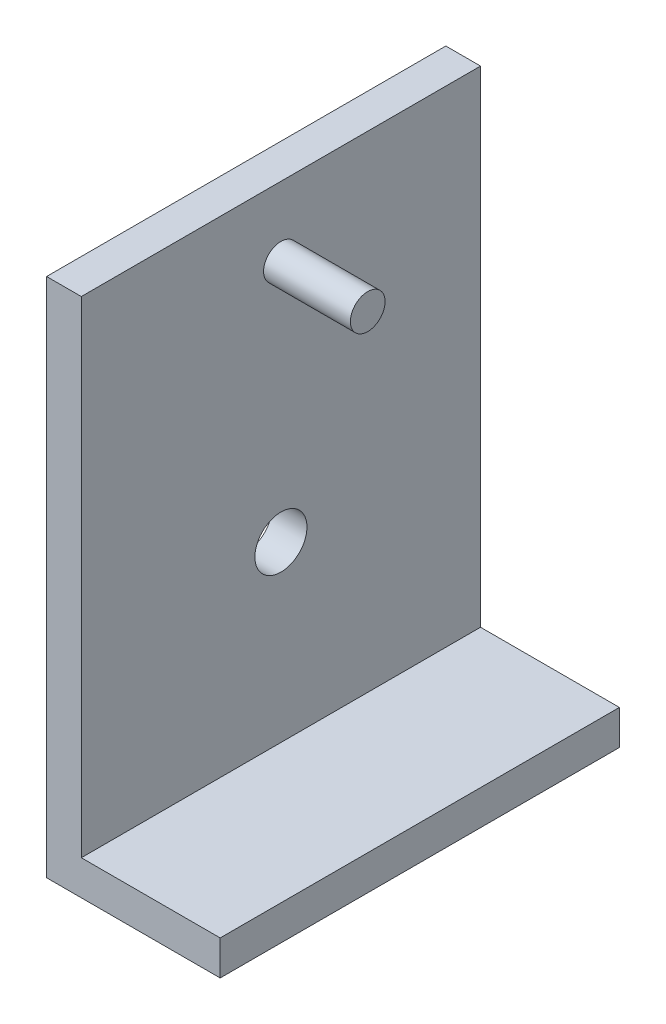
ISO-10303-21;
HEADER;
FILE_DESCRIPTION(('STEP AP214'),'2;1');
FILE_NAME('part.step','',(''),(''),'','','');
FILE_SCHEMA(('AUTOMOTIVE_DESIGN { 1 0 10303 214 1 1 1 1 }'));
ENDSEC;
DATA;
#1=APPLICATION_CONTEXT('core data for automotive mechanical design processes');
#2=APPLICATION_PROTOCOL_DEFINITION('international standard','automotive_design',2000,#1);
#3=PRODUCT_CONTEXT('',#1,'mechanical');
#4=PRODUCT('Part','Part','',(#3));
#5=PRODUCT_RELATED_PRODUCT_CATEGORY('part','',(#4));
#6=PRODUCT_DEFINITION_FORMATION('','',#4);
#7=PRODUCT_DEFINITION_CONTEXT('part definition',#1,'design');
#8=PRODUCT_DEFINITION('design','',#6,#7);
#9=PRODUCT_DEFINITION_SHAPE('','',#8);
#10=(LENGTH_UNIT() NAMED_UNIT(*) SI_UNIT(.MILLI.,.METRE.));
#11=(NAMED_UNIT(*) PLANE_ANGLE_UNIT() SI_UNIT($,.RADIAN.));
#12=(NAMED_UNIT(*) SI_UNIT($,.STERADIAN.) SOLID_ANGLE_UNIT());
#13=UNCERTAINTY_MEASURE_WITH_UNIT(LENGTH_MEASURE(1.E-05),#10,'distance_accuracy_value','');
#14=(GEOMETRIC_REPRESENTATION_CONTEXT(3) GLOBAL_UNCERTAINTY_ASSIGNED_CONTEXT((#13)) GLOBAL_UNIT_ASSIGNED_CONTEXT((#10,
#11,#12)) REPRESENTATION_CONTEXT('',''));
#15=CARTESIAN_POINT('',(0.,0.,0.));
#16=DIRECTION('',(0.,0.,1.));
#17=DIRECTION('',(1.,0.,0.));
#18=AXIS2_PLACEMENT_3D('',#15,#16,#17);
#19=CARTESIAN_POINT('',(10.,150.,57.5));
#20=DIRECTION('',(0.,-1.,0.));
#21=DIRECTION('',(0.,0.,-1.));
#22=AXIS2_PLACEMENT_3D('',#19,#20,#21);
#23=PLANE('',#22);
#24=DIRECTION('',(-1.,0.,0.));
#25=VECTOR('',#24,1.);
#26=CARTESIAN_POINT('',(10.,150.,-57.5));
#27=LINE('',#26,#25);
#28=CARTESIAN_POINT('',(10.,150.,-57.5));
#29=VERTEX_POINT('',#28);
#30=CARTESIAN_POINT('',(0.,150.,-57.5));
#31=VERTEX_POINT('',#30);
#32=EDGE_CURVE('E124',#29,#31,#27,.T.);
#33=ORIENTED_EDGE('',*,*,#32,.T.);
#34=DIRECTION('',(0.,0.,-1.));
#35=VECTOR('',#34,1.);
#36=CARTESIAN_POINT('',(0.,150.,57.5));
#37=LINE('',#36,#35);
#38=CARTESIAN_POINT('',(0.,150.,57.5));
#39=VERTEX_POINT('',#38);
#40=EDGE_CURVE('E47',#39,#31,#37,.T.);
#41=ORIENTED_EDGE('',*,*,#40,.F.);
#42=DIRECTION('',(-1.,0.,0.));
#43=VECTOR('',#42,1.);
#44=CARTESIAN_POINT('',(10.,150.,57.5));
#45=LINE('',#44,#43);
#46=CARTESIAN_POINT('',(10.,150.,57.5));
#47=VERTEX_POINT('',#46);
#48=EDGE_CURVE('E135',#47,#39,#45,.T.);
#49=ORIENTED_EDGE('',*,*,#48,.F.);
#50=DIRECTION('',(0.,0.,-1.));
#51=VECTOR('',#50,1.);
#52=CARTESIAN_POINT('',(10.,150.,57.5));
#53=LINE('',#52,#51);
#54=EDGE_CURVE('E120',#47,#29,#53,.T.);
#55=ORIENTED_EDGE('',*,*,#54,.T.);
#56=EDGE_LOOP('',(#33,#41,#49,#55));
#57=FACE_BOUND('',#56,.T.);
#58=ADVANCED_FACE('F39',(#57),#23,.F.);
#59=CARTESIAN_POINT('',(0.,150.,57.5));
#60=DIRECTION('',(1.,0.,0.));
#61=DIRECTION('',(0.,1.,0.));
#62=AXIS2_PLACEMENT_3D('',#59,#60,#61);
#63=PLANE('',#62);
#64=CARTESIAN_POINT('',(0.,60.,0.));
#65=DIRECTION('',(-1.,0.,0.));
#66=DIRECTION('',(0.,-1.,0.));
#67=AXIS2_PLACEMENT_3D('',#64,#65,#66);
#68=CIRCLE('',#67,7.49999999999999);
#69=CARTESIAN_POINT('',(0.,52.5,0.));
#70=VERTEX_POINT('',#69);
#71=EDGE_CURVE('E143',#70,#70,#68,.T.);
#72=ORIENTED_EDGE('',*,*,#71,.F.);
#73=EDGE_LOOP('',(#72));
#74=FACE_BOUND('',#73,.T.);
#75=DIRECTION('',(0.,-1.,0.));
#76=VECTOR('',#75,1.);
#77=CARTESIAN_POINT('',(0.,150.,-57.5));
#78=LINE('',#77,#76);
#79=CARTESIAN_POINT('',(0.,0.,-57.5));
#80=VERTEX_POINT('',#79);
#81=EDGE_CURVE('E127',#31,#80,#78,.T.);
#82=ORIENTED_EDGE('',*,*,#81,.T.);
#83=DIRECTION('',(0.,0.,-1.));
#84=VECTOR('',#83,1.);
#85=CARTESIAN_POINT('',(0.,0.,57.5));
#86=LINE('',#85,#84);
#87=CARTESIAN_POINT('',(0.,0.,57.5));
#88=VERTEX_POINT('',#87);
#89=EDGE_CURVE('E139',#88,#80,#86,.T.);
#90=ORIENTED_EDGE('',*,*,#89,.F.);
#91=DIRECTION('',(0.,-1.,0.));
#92=VECTOR('',#91,1.);
#93=CARTESIAN_POINT('',(0.,150.,57.5));
#94=LINE('',#93,#92);
#95=EDGE_CURVE('E93',#39,#88,#94,.T.);
#96=ORIENTED_EDGE('',*,*,#95,.F.);
#97=ORIENTED_EDGE('',*,*,#40,.T.);
#98=EDGE_LOOP('',(#82,#90,#96,#97));
#99=FACE_BOUND('',#98,.T.);
#100=ADVANCED_FACE('F157',(#74,#99),#63,.F.);
#101=CARTESIAN_POINT('',(0.,0.,57.5));
#102=DIRECTION('',(0.,1.,0.));
#103=DIRECTION('',(0.,0.,1.));
#104=AXIS2_PLACEMENT_3D('',#101,#102,#103);
#105=PLANE('',#104);
#106=DIRECTION('',(1.,0.,0.));
#107=VECTOR('',#106,1.);
#108=CARTESIAN_POINT('',(0.,0.,-57.5));
#109=LINE('',#108,#107);
#110=CARTESIAN_POINT('',(50.,0.,-57.5));
#111=VERTEX_POINT('',#110);
#112=EDGE_CURVE('E130',#80,#111,#109,.T.);
#113=ORIENTED_EDGE('',*,*,#112,.T.);
#114=DIRECTION('',(0.,0.,-1.));
#115=VECTOR('',#114,1.);
#116=CARTESIAN_POINT('',(50.,0.,57.5));
#117=LINE('',#116,#115);
#118=CARTESIAN_POINT('',(50.,0.,57.5));
#119=VERTEX_POINT('',#118);
#120=EDGE_CURVE('E115',#119,#111,#117,.T.);
#121=ORIENTED_EDGE('',*,*,#120,.F.);
#122=DIRECTION('',(1.,0.,0.));
#123=VECTOR('',#122,1.);
#124=CARTESIAN_POINT('',(0.,0.,57.5));
#125=LINE('',#124,#123);
#126=EDGE_CURVE('E106',#88,#119,#125,.T.);
#127=ORIENTED_EDGE('',*,*,#126,.F.);
#128=ORIENTED_EDGE('',*,*,#89,.T.);
#129=EDGE_LOOP('',(#113,#121,#127,#128));
#130=FACE_BOUND('',#129,.T.);
#131=ADVANCED_FACE('F160',(#130),#105,.F.);
#132=CARTESIAN_POINT('',(50.,0.,57.5));
#133=DIRECTION('',(-1.,0.,0.));
#134=DIRECTION('',(0.,0.,1.));
#135=AXIS2_PLACEMENT_3D('',#132,#133,#134);
#136=PLANE('',#135);
#137=DIRECTION('',(0.,1.,0.));
#138=VECTOR('',#137,1.);
#139=CARTESIAN_POINT('',(50.,0.,-57.5));
#140=LINE('',#139,#138);
#141=CARTESIAN_POINT('',(50.,10.,-57.5));
#142=VERTEX_POINT('',#141);
#143=EDGE_CURVE('E114',#111,#142,#140,.T.);
#144=ORIENTED_EDGE('',*,*,#143,.T.);
#145=DIRECTION('',(0.,0.,-1.));
#146=VECTOR('',#145,1.);
#147=CARTESIAN_POINT('',(50.,10.,57.5));
#148=LINE('',#147,#146);
#149=CARTESIAN_POINT('',(50.,10.,57.5));
#150=VERTEX_POINT('',#149);
#151=EDGE_CURVE('E111',#150,#142,#148,.T.);
#152=ORIENTED_EDGE('',*,*,#151,.F.);
#153=DIRECTION('',(0.,1.,0.));
#154=VECTOR('',#153,1.);
#155=CARTESIAN_POINT('',(50.,0.,57.5));
#156=LINE('',#155,#154);
#157=EDGE_CURVE('E100',#119,#150,#156,.T.);
#158=ORIENTED_EDGE('',*,*,#157,.F.);
#159=ORIENTED_EDGE('',*,*,#120,.T.);
#160=EDGE_LOOP('',(#144,#152,#158,#159));
#161=FACE_BOUND('',#160,.T.);
#162=ADVANCED_FACE('F112',(#161),#136,.F.);
#163=CARTESIAN_POINT('',(50.,10.,57.5));
#164=DIRECTION('',(0.,-1.,0.));
#165=DIRECTION('',(1.,0.,0.));
#166=AXIS2_PLACEMENT_3D('',#163,#164,#165);
#167=PLANE('',#166);
#168=DIRECTION('',(-1.,0.,0.));
#169=VECTOR('',#168,1.);
#170=CARTESIAN_POINT('',(50.,10.,-57.5));
#171=LINE('',#170,#169);
#172=CARTESIAN_POINT('',(10.,9.99999999999999,-57.5));
#173=VERTEX_POINT('',#172);
#174=EDGE_CURVE('E78',#142,#173,#171,.T.);
#175=ORIENTED_EDGE('',*,*,#174,.T.);
#176=DIRECTION('',(0.,0.,-1.));
#177=VECTOR('',#176,1.);
#178=CARTESIAN_POINT('',(10.,9.99999999999999,57.5));
#179=LINE('',#178,#177);
#180=CARTESIAN_POINT('',(10.,9.99999999999999,57.5));
#181=VERTEX_POINT('',#180);
#182=EDGE_CURVE('E116',#181,#173,#179,.T.);
#183=ORIENTED_EDGE('',*,*,#182,.F.);
#184=DIRECTION('',(-1.,0.,0.));
#185=VECTOR('',#184,1.);
#186=CARTESIAN_POINT('',(50.,10.,57.5));
#187=LINE('',#186,#185);
#188=EDGE_CURVE('E104',#150,#181,#187,.T.);
#189=ORIENTED_EDGE('',*,*,#188,.F.);
#190=ORIENTED_EDGE('',*,*,#151,.T.);
#191=EDGE_LOOP('',(#175,#183,#189,#190));
#192=FACE_BOUND('',#191,.T.);
#193=ADVANCED_FACE('F118',(#192),#167,.F.);
#194=CARTESIAN_POINT('',(10.,9.99999999999999,57.5));
#195=DIRECTION('',(-1.,0.,0.));
#196=DIRECTION('',(0.,-1.,0.));
#197=AXIS2_PLACEMENT_3D('',#194,#195,#196);
#198=PLANE('',#197);
#199=CARTESIAN_POINT('',(10.,130.,0.));
#200=DIRECTION('',(-1.,0.,0.));
#201=DIRECTION('',(0.,-1.,0.));
#202=AXIS2_PLACEMENT_3D('',#199,#200,#201);
#203=CIRCLE('',#202,5.);
#204=CARTESIAN_POINT('',(10.,125.,0.));
#205=VERTEX_POINT('',#204);
#206=EDGE_CURVE('E11',#205,#205,#203,.F.);
#207=ORIENTED_EDGE('',*,*,#206,.F.);
#208=EDGE_LOOP('',(#207));
#209=FACE_BOUND('',#208,.T.);
#210=CARTESIAN_POINT('',(10.,60.,0.));
#211=DIRECTION('',(-1.,0.,0.));
#212=DIRECTION('',(0.,-1.,0.));
#213=AXIS2_PLACEMENT_3D('',#210,#211,#212);
#214=CIRCLE('',#213,7.49999999999999);
#215=CARTESIAN_POINT('',(10.,52.5,0.));
#216=VERTEX_POINT('',#215);
#217=EDGE_CURVE('E128',#216,#216,#214,.T.);
#218=ORIENTED_EDGE('',*,*,#217,.T.);
#219=EDGE_LOOP('',(#218));
#220=FACE_BOUND('',#219,.T.);
#221=DIRECTION('',(0.,1.,0.));
#222=VECTOR('',#221,1.);
#223=CARTESIAN_POINT('',(10.,9.99999999999999,-57.5));
#224=LINE('',#223,#222);
#225=EDGE_CURVE('E84',#173,#29,#224,.T.);
#226=ORIENTED_EDGE('',*,*,#225,.T.);
#227=ORIENTED_EDGE('',*,*,#54,.F.);
#228=DIRECTION('',(0.,1.,0.));
#229=VECTOR('',#228,1.);
#230=CARTESIAN_POINT('',(10.,9.99999999999999,57.5));
#231=LINE('',#230,#229);
#232=EDGE_CURVE('E55',#181,#47,#231,.T.);
#233=ORIENTED_EDGE('',*,*,#232,.F.);
#234=ORIENTED_EDGE('',*,*,#182,.T.);
#235=EDGE_LOOP('',(#226,#227,#233,#234));
#236=FACE_BOUND('',#235,.T.);
#237=ADVANCED_FACE('F165',(#209,#220,#236),#198,.F.);
#238=CARTESIAN_POINT('',(0.,0.,57.5));
#239=DIRECTION('',(0.,0.,1.));
#240=DIRECTION('',(1.,0.,0.));
#241=AXIS2_PLACEMENT_3D('',#238,#239,#240);
#242=PLANE('',#241);
#243=ORIENTED_EDGE('',*,*,#48,.T.);
#244=ORIENTED_EDGE('',*,*,#95,.T.);
#245=ORIENTED_EDGE('',*,*,#126,.T.);
#246=ORIENTED_EDGE('',*,*,#157,.T.);
#247=ORIENTED_EDGE('',*,*,#188,.T.);
#248=ORIENTED_EDGE('',*,*,#232,.T.);
#249=EDGE_LOOP('',(#243,#244,#245,#246,#247,#248));
#250=FACE_BOUND('',#249,.T.);
#251=ADVANCED_FACE('F102',(#250),#242,.T.);
#252=CARTESIAN_POINT('',(0.,0.,-57.5));
#253=DIRECTION('',(0.,0.,1.));
#254=DIRECTION('',(1.,0.,0.));
#255=AXIS2_PLACEMENT_3D('',#252,#253,#254);
#256=PLANE('',#255);
#257=ORIENTED_EDGE('',*,*,#32,.F.);
#258=ORIENTED_EDGE('',*,*,#225,.F.);
#259=ORIENTED_EDGE('',*,*,#174,.F.);
#260=ORIENTED_EDGE('',*,*,#143,.F.);
#261=ORIENTED_EDGE('',*,*,#112,.F.);
#262=ORIENTED_EDGE('',*,*,#81,.F.);
#263=EDGE_LOOP('',(#257,#258,#259,#260,#261,#262));
#264=FACE_BOUND('',#263,.T.);
#265=ADVANCED_FACE('F163',(#264),#256,.F.);
#266=CARTESIAN_POINT('',(50.,60.,0.));
#267=DIRECTION('',(-1.,0.,0.));
#268=DIRECTION('',(0.,-1.,0.));
#269=AXIS2_PLACEMENT_3D('',#266,#267,#268);
#270=CYLINDRICAL_SURFACE('',#269,7.49999999999999);
#271=ORIENTED_EDGE('',*,*,#71,.T.);
#272=EDGE_LOOP('',(#271));
#273=FACE_BOUND('',#272,.T.);
#274=ORIENTED_EDGE('',*,*,#217,.F.);
#275=EDGE_LOOP('',(#274));
#276=FACE_BOUND('',#275,.T.);
#277=ADVANCED_FACE('F207',(#273,#276),#270,.F.);
#278=CARTESIAN_POINT('',(35.,130.,0.));
#279=DIRECTION('',(-1.,0.,0.));
#280=DIRECTION('',(0.,-1.,0.));
#281=AXIS2_PLACEMENT_3D('',#278,#279,#280);
#282=CYLINDRICAL_SURFACE('',#281,5.);
#283=CARTESIAN_POINT('',(35.,130.,0.));
#284=DIRECTION('',(1.,0.,0.));
#285=DIRECTION('',(0.,1.,0.));
#286=AXIS2_PLACEMENT_3D('',#283,#284,#285);
#287=CIRCLE('',#286,5.);
#288=CARTESIAN_POINT('',(35.,135.,0.));
#289=VERTEX_POINT('',#288);
#290=EDGE_CURVE('E147',#289,#289,#287,.T.);
#291=ORIENTED_EDGE('',*,*,#290,.F.);
#292=EDGE_LOOP('',(#291));
#293=FACE_BOUND('',#292,.T.);
#294=ORIENTED_EDGE('',*,*,#206,.T.);
#295=EDGE_LOOP('',(#294));
#296=FACE_BOUND('',#295,.T.);
#297=ADVANCED_FACE('F214',(#293,#296),#282,.T.);
#298=CARTESIAN_POINT('',(35.,130.,0.));
#299=DIRECTION('',(1.,0.,0.));
#300=DIRECTION('',(0.,1.,0.));
#301=AXIS2_PLACEMENT_3D('',#298,#299,#300);
#302=PLANE('',#301);
#303=ORIENTED_EDGE('',*,*,#290,.T.);
#304=EDGE_LOOP('',(#303));
#305=FACE_BOUND('',#304,.T.);
#306=ADVANCED_FACE('F220',(#305),#302,.T.);
#307=CLOSED_SHELL('',(#58,#100,#131,#162,#193,#237,#251,#265,#277,#297,#306));
#308=MANIFOLD_SOLID_BREP('B2',#307);
#309=ADVANCED_BREP_SHAPE_REPRESENTATION('',(#18,#308),#14);
#310=SHAPE_DEFINITION_REPRESENTATION(#9,#309);
ENDSEC;
END-ISO-10303-21;
